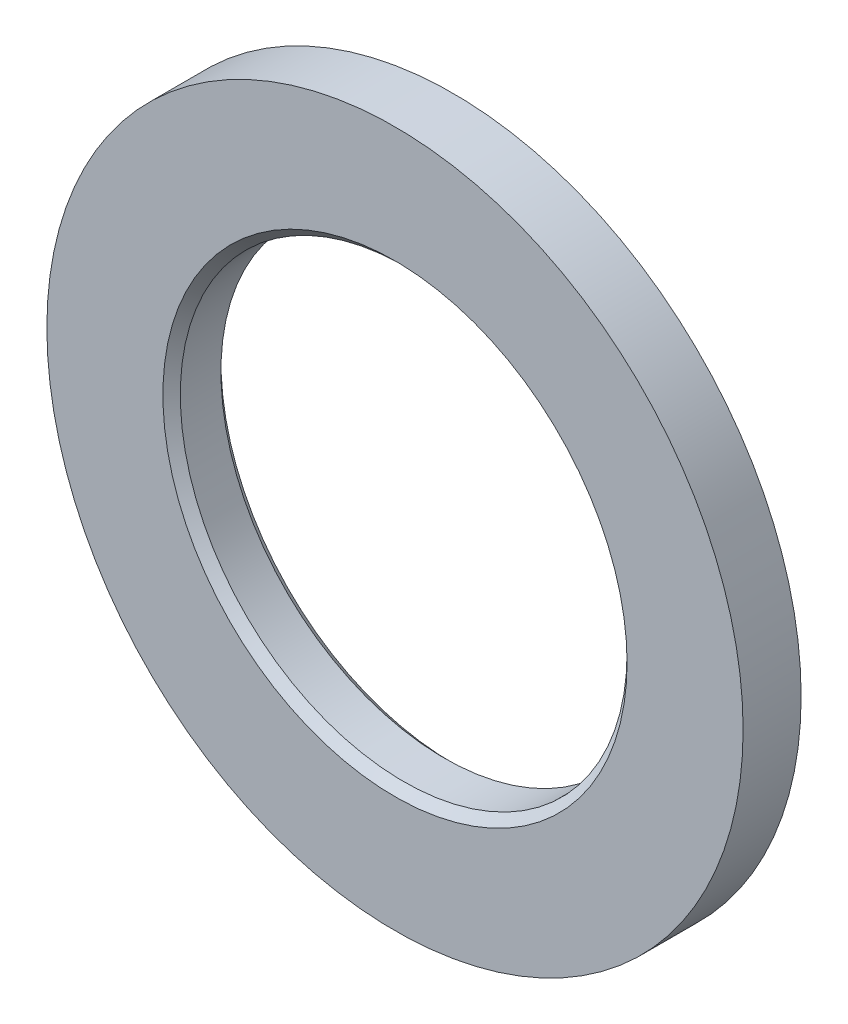
ISO-10303-21;
HEADER;
FILE_DESCRIPTION(('STEP AP214'),'2;1');
FILE_NAME('part.step','',(''),(''),'','','');
FILE_SCHEMA(('AUTOMOTIVE_DESIGN { 1 0 10303 214 1 1 1 1 }'));
ENDSEC;
DATA;
#1=APPLICATION_CONTEXT('core data for automotive mechanical design processes');
#2=APPLICATION_PROTOCOL_DEFINITION('international standard','automotive_design',2000,#1);
#3=PRODUCT_CONTEXT('',#1,'mechanical');
#4=PRODUCT('Part','Part','',(#3));
#5=PRODUCT_RELATED_PRODUCT_CATEGORY('part','',(#4));
#6=PRODUCT_DEFINITION_FORMATION('','',#4);
#7=PRODUCT_DEFINITION_CONTEXT('part definition',#1,'design');
#8=PRODUCT_DEFINITION('design','',#6,#7);
#9=PRODUCT_DEFINITION_SHAPE('','',#8);
#10=(LENGTH_UNIT() NAMED_UNIT(*) SI_UNIT(.MILLI.,.METRE.));
#11=(NAMED_UNIT(*) PLANE_ANGLE_UNIT() SI_UNIT($,.RADIAN.));
#12=(NAMED_UNIT(*) SI_UNIT($,.STERADIAN.) SOLID_ANGLE_UNIT());
#13=UNCERTAINTY_MEASURE_WITH_UNIT(LENGTH_MEASURE(1.E-05),#10,'distance_accuracy_value','');
#14=(GEOMETRIC_REPRESENTATION_CONTEXT(3) GLOBAL_UNCERTAINTY_ASSIGNED_CONTEXT((#13)) GLOBAL_UNIT_ASSIGNED_CONTEXT((#10,
#11,#12)) REPRESENTATION_CONTEXT('',''));
#15=CARTESIAN_POINT('',(0.,0.,0.));
#16=DIRECTION('',(0.,0.,1.));
#17=DIRECTION('',(1.,0.,0.));
#18=AXIS2_PLACEMENT_3D('',#15,#16,#17);
#19=CARTESIAN_POINT('',(0.,0.,5.));
#20=DIRECTION('',(0.,0.,-1.));
#21=DIRECTION('',(-1.,0.,0.));
#22=AXIS2_PLACEMENT_3D('',#19,#20,#21);
#23=CYLINDRICAL_SURFACE('',#22,30.);
#24=CARTESIAN_POINT('',(0.,0.,5.));
#25=DIRECTION('',(0.,0.,1.));
#26=DIRECTION('',(1.,0.,0.));
#27=AXIS2_PLACEMENT_3D('',#24,#25,#26);
#28=CIRCLE('',#27,30.);
#29=CARTESIAN_POINT('',(30.,0.,5.));
#30=VERTEX_POINT('',#29);
#31=EDGE_CURVE('E10',#30,#30,#28,.T.);
#32=ORIENTED_EDGE('',*,*,#31,.F.);
#33=EDGE_LOOP('',(#32));
#34=FACE_BOUND('',#33,.T.);
#35=CARTESIAN_POINT('',(0.,0.,0.));
#36=DIRECTION('',(0.,0.,1.));
#37=DIRECTION('',(1.,0.,0.));
#38=AXIS2_PLACEMENT_3D('',#35,#36,#37);
#39=CIRCLE('',#38,30.);
#40=CARTESIAN_POINT('',(30.,0.,0.));
#41=VERTEX_POINT('',#40);
#42=EDGE_CURVE('E37',#41,#41,#39,.T.);
#43=ORIENTED_EDGE('',*,*,#42,.T.);
#44=EDGE_LOOP('',(#43));
#45=FACE_BOUND('',#44,.T.);
#46=ADVANCED_FACE('F34',(#34,#45),#23,.T.);
#47=CARTESIAN_POINT('',(0.,0.,5.));
#48=DIRECTION('',(0.,0.,1.));
#49=DIRECTION('',(1.,0.,0.));
#50=AXIS2_PLACEMENT_3D('',#47,#48,#49);
#51=PLANE('',#50);
#52=CARTESIAN_POINT('',(0.,0.,5.));
#53=DIRECTION('',(0.,0.,1.));
#54=DIRECTION('',(1.,0.,0.));
#55=AXIS2_PLACEMENT_3D('',#52,#53,#54);
#56=CIRCLE('',#55,20.);
#57=CARTESIAN_POINT('',(20.,0.,5.));
#58=VERTEX_POINT('',#57);
#59=EDGE_CURVE('E44',#58,#58,#56,.T.);
#60=ORIENTED_EDGE('',*,*,#59,.F.);
#61=EDGE_LOOP('',(#60));
#62=FACE_BOUND('',#61,.T.);
#63=ORIENTED_EDGE('',*,*,#31,.T.);
#64=EDGE_LOOP('',(#63));
#65=FACE_BOUND('',#64,.T.);
#66=ADVANCED_FACE('F79',(#62,#65),#51,.T.);
#67=CARTESIAN_POINT('',(0.,0.,0.));
#68=DIRECTION('',(0.,0.,1.));
#69=DIRECTION('',(1.,0.,0.));
#70=AXIS2_PLACEMENT_3D('',#67,#68,#69);
#71=PLANE('',#70);
#72=CARTESIAN_POINT('',(0.,0.,0.));
#73=DIRECTION('',(0.,0.,1.));
#74=DIRECTION('',(1.,0.,0.));
#75=AXIS2_PLACEMENT_3D('',#72,#73,#74);
#76=CIRCLE('',#75,20.);
#77=CARTESIAN_POINT('',(20.,0.,0.));
#78=VERTEX_POINT('',#77);
#79=EDGE_CURVE('E54',#78,#78,#76,.T.);
#80=ORIENTED_EDGE('',*,*,#79,.T.);
#81=EDGE_LOOP('',(#80));
#82=FACE_BOUND('',#81,.T.);
#83=ORIENTED_EDGE('',*,*,#42,.F.);
#84=EDGE_LOOP('',(#83));
#85=FACE_BOUND('',#84,.T.);
#86=ADVANCED_FACE('F58',(#82,#85),#71,.F.);
#87=CARTESIAN_POINT('',(0.,0.,0.));
#88=DIRECTION('',(0.,0.,1.));
#89=DIRECTION('',(1.,0.,0.));
#90=AXIS2_PLACEMENT_3D('',#87,#88,#89);
#91=CYLINDRICAL_SURFACE('',#90,19.25);
#92=CARTESIAN_POINT('',(0.,0.,0.750000000000001));
#93=DIRECTION('',(0.,0.,1.));
#94=DIRECTION('',(1.,0.,0.));
#95=AXIS2_PLACEMENT_3D('',#92,#93,#94);
#96=CIRCLE('',#95,19.25);
#97=CARTESIAN_POINT('',(19.25,0.,0.750000000000001));
#98=VERTEX_POINT('',#97);
#99=EDGE_CURVE('E51',#98,#98,#96,.T.);
#100=ORIENTED_EDGE('',*,*,#99,.F.);
#101=EDGE_LOOP('',(#100));
#102=FACE_BOUND('',#101,.T.);
#103=CARTESIAN_POINT('',(0.,0.,4.25));
#104=DIRECTION('',(0.,0.,1.));
#105=DIRECTION('',(1.,0.,0.));
#106=AXIS2_PLACEMENT_3D('',#103,#104,#105);
#107=CIRCLE('',#106,19.25);
#108=CARTESIAN_POINT('',(19.25,0.,4.25));
#109=VERTEX_POINT('',#108);
#110=EDGE_CURVE('E48',#109,#109,#107,.T.);
#111=ORIENTED_EDGE('',*,*,#110,.T.);
#112=EDGE_LOOP('',(#111));
#113=FACE_BOUND('',#112,.T.);
#114=ADVANCED_FACE('F68',(#102,#113),#91,.F.);
#115=CARTESIAN_POINT('',(0.,0.,5.));
#116=DIRECTION('',(0.,0.,1.));
#117=DIRECTION('',(1.,0.,0.));
#118=AXIS2_PLACEMENT_3D('',#115,#116,#117);
#119=CONICAL_SURFACE('',#118,20.,0.785398163397449);
#120=ORIENTED_EDGE('',*,*,#110,.F.);
#121=EDGE_LOOP('',(#120));
#122=FACE_BOUND('',#121,.T.);
#123=ORIENTED_EDGE('',*,*,#59,.T.);
#124=EDGE_LOOP('',(#123));
#125=FACE_BOUND('',#124,.T.);
#126=ADVANCED_FACE('F64',(#122,#125),#119,.F.);
#127=CARTESIAN_POINT('',(0.,0.,0.750000000000001));
#128=DIRECTION('',(0.,0.,-1.));
#129=DIRECTION('',(-1.,0.,0.));
#130=AXIS2_PLACEMENT_3D('',#127,#128,#129);
#131=CONICAL_SURFACE('',#130,19.25,0.785398163397448);
#132=ORIENTED_EDGE('',*,*,#79,.F.);
#133=EDGE_LOOP('',(#132));
#134=FACE_BOUND('',#133,.T.);
#135=ORIENTED_EDGE('',*,*,#99,.T.);
#136=EDGE_LOOP('',(#135));
#137=FACE_BOUND('',#136,.T.);
#138=ADVANCED_FACE('F61',(#134,#137),#131,.F.);
#139=CLOSED_SHELL('',(#46,#66,#86,#114,#126,#138));
#140=MANIFOLD_SOLID_BREP('B2',#139);
#141=ADVANCED_BREP_SHAPE_REPRESENTATION('',(#18,#140),#14);
#142=SHAPE_DEFINITION_REPRESENTATION(#9,#141);
ENDSEC;
END-ISO-10303-21;
